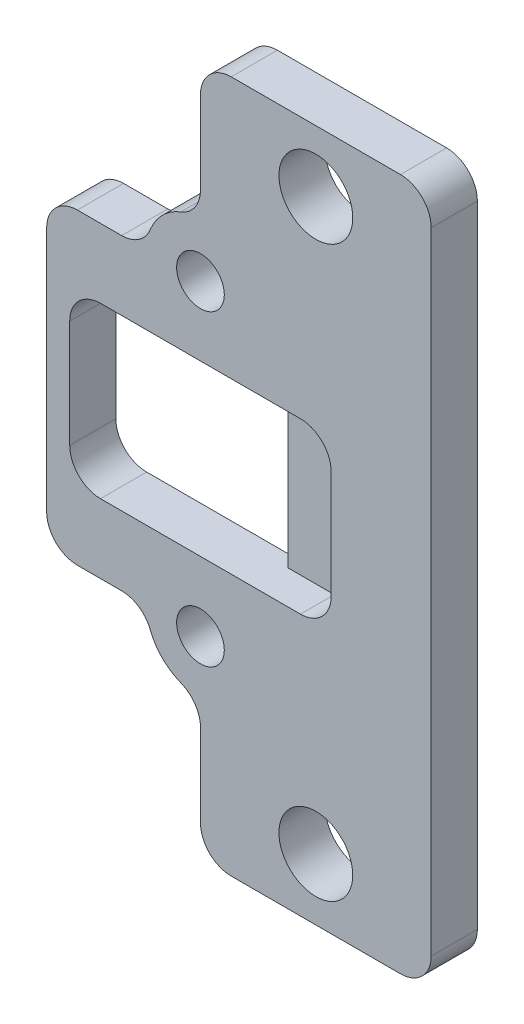
ISO-10303-21;
HEADER;
FILE_DESCRIPTION(('STEP AP214'),'2;1');
FILE_NAME('part.step','',(''),(''),'','','');
FILE_SCHEMA(('AUTOMOTIVE_DESIGN { 1 0 10303 214 1 1 1 1 }'));
ENDSEC;
DATA;
#1=APPLICATION_CONTEXT('core data for automotive mechanical design processes');
#2=APPLICATION_PROTOCOL_DEFINITION('international standard','automotive_design',2000,#1);
#3=PRODUCT_CONTEXT('',#1,'mechanical');
#4=PRODUCT('Part','Part','',(#3));
#5=PRODUCT_RELATED_PRODUCT_CATEGORY('part','',(#4));
#6=PRODUCT_DEFINITION_FORMATION('','',#4);
#7=PRODUCT_DEFINITION_CONTEXT('part definition',#1,'design');
#8=PRODUCT_DEFINITION('design','',#6,#7);
#9=PRODUCT_DEFINITION_SHAPE('','',#8);
#10=(LENGTH_UNIT() NAMED_UNIT(*) SI_UNIT(.MILLI.,.METRE.));
#11=(NAMED_UNIT(*) PLANE_ANGLE_UNIT() SI_UNIT($,.RADIAN.));
#12=(NAMED_UNIT(*) SI_UNIT($,.STERADIAN.) SOLID_ANGLE_UNIT());
#13=UNCERTAINTY_MEASURE_WITH_UNIT(LENGTH_MEASURE(1.E-05),#10,'distance_accuracy_value','');
#14=(GEOMETRIC_REPRESENTATION_CONTEXT(3) GLOBAL_UNCERTAINTY_ASSIGNED_CONTEXT((#13)) GLOBAL_UNIT_ASSIGNED_CONTEXT((#10,
#11,#12)) REPRESENTATION_CONTEXT('',''));
#15=CARTESIAN_POINT('',(0.,0.,0.));
#16=DIRECTION('',(0.,0.,1.));
#17=DIRECTION('',(1.,0.,0.));
#18=AXIS2_PLACEMENT_3D('',#15,#16,#17);
#19=CARTESIAN_POINT('',(-7.5,10.,3.));
#20=DIRECTION('',(0.,0.,-1.));
#21=DIRECTION('',(-1.,0.,0.));
#22=AXIS2_PLACEMENT_3D('',#19,#20,#21);
#23=CYLINDRICAL_SURFACE('',#22,1.55);
#24=CARTESIAN_POINT('',(-7.5,10.,3.));
#25=DIRECTION('',(0.,0.,1.));
#26=DIRECTION('',(1.,0.,0.));
#27=AXIS2_PLACEMENT_3D('',#24,#25,#26);
#28=CIRCLE('',#27,1.55);
#29=CARTESIAN_POINT('',(-5.95,10.,3.));
#30=VERTEX_POINT('',#29);
#31=EDGE_CURVE('E322',#30,#30,#28,.T.);
#32=ORIENTED_EDGE('',*,*,#31,.T.);
#33=EDGE_LOOP('',(#32));
#34=FACE_BOUND('',#33,.T.);
#35=CARTESIAN_POINT('',(-7.5,10.,0.));
#36=DIRECTION('',(0.,0.,1.));
#37=DIRECTION('',(1.,0.,0.));
#38=AXIS2_PLACEMENT_3D('',#35,#36,#37);
#39=CIRCLE('',#38,1.55);
#40=CARTESIAN_POINT('',(-5.95,10.,0.));
#41=VERTEX_POINT('',#40);
#42=EDGE_CURVE('E357',#41,#41,#39,.T.);
#43=ORIENTED_EDGE('',*,*,#42,.F.);
#44=EDGE_LOOP('',(#43));
#45=FACE_BOUND('',#44,.T.);
#46=ADVANCED_FACE('F113',(#34,#45),#23,.F.);
#47=CARTESIAN_POINT('',(0.,0.,0.));
#48=DIRECTION('',(0.,0.,1.));
#49=DIRECTION('',(1.,0.,0.));
#50=AXIS2_PLACEMENT_3D('',#47,#48,#49);
#51=PLANE('',#50);
#52=DIRECTION('',(0.,1.,0.));
#53=VECTOR('',#52,1.);
#54=CARTESIAN_POINT('',(-4.,-5.5,0.));
#55=LINE('',#54,#53);
#56=CARTESIAN_POINT('',(-4.,-5.5,0.));
#57=VERTEX_POINT('',#56);
#58=CARTESIAN_POINT('',(-4.,5.5,0.));
#59=VERTEX_POINT('',#58);
#60=EDGE_CURVE('E317',#57,#59,#55,.T.);
#61=ORIENTED_EDGE('',*,*,#60,.T.);
#62=DIRECTION('',(-1.,0.,0.));
#63=VECTOR('',#62,1.);
#64=CARTESIAN_POINT('',(0.,5.5,0.));
#65=LINE('',#64,#63);
#66=CARTESIAN_POINT('',(-14.,5.5,0.));
#67=VERTEX_POINT('',#66);
#68=EDGE_CURVE('E323',#59,#67,#65,.T.);
#69=ORIENTED_EDGE('',*,*,#68,.T.);
#70=CARTESIAN_POINT('',(-14.,3.5,0.));
#71=DIRECTION('',(0.,0.,1.));
#72=DIRECTION('',(1.,0.,0.));
#73=AXIS2_PLACEMENT_3D('',#70,#71,#72);
#74=CIRCLE('',#73,2.);
#75=CARTESIAN_POINT('',(-16.,3.5,0.));
#76=VERTEX_POINT('',#75);
#77=EDGE_CURVE('E553',#67,#76,#74,.T.);
#78=ORIENTED_EDGE('',*,*,#77,.T.);
#79=DIRECTION('',(0.,1.,0.));
#80=VECTOR('',#79,1.);
#81=CARTESIAN_POINT('',(-16.,0.,0.));
#82=LINE('',#81,#80);
#83=CARTESIAN_POINT('',(-16.,-3.5,0.));
#84=VERTEX_POINT('',#83);
#85=EDGE_CURVE('E437',#84,#76,#82,.T.);
#86=ORIENTED_EDGE('',*,*,#85,.F.);
#87=CARTESIAN_POINT('',(-14.,-3.5,0.));
#88=DIRECTION('',(0.,0.,1.));
#89=DIRECTION('',(1.,0.,0.));
#90=AXIS2_PLACEMENT_3D('',#87,#88,#89);
#91=CIRCLE('',#90,2.);
#92=CARTESIAN_POINT('',(-14.,-5.5,0.));
#93=VERTEX_POINT('',#92);
#94=EDGE_CURVE('E319',#84,#93,#91,.T.);
#95=ORIENTED_EDGE('',*,*,#94,.T.);
#96=DIRECTION('',(-1.,0.,0.));
#97=VECTOR('',#96,1.);
#98=CARTESIAN_POINT('',(0.,-5.5,0.));
#99=LINE('',#98,#97);
#100=EDGE_CURVE('E311',#57,#93,#99,.T.);
#101=ORIENTED_EDGE('',*,*,#100,.F.);
#102=EDGE_LOOP('',(#61,#69,#78,#86,#95,#101));
#103=FACE_BOUND('',#102,.T.);
#104=CARTESIAN_POINT('',(0.,-18.5,0.));
#105=DIRECTION('',(0.,0.,1.));
#106=DIRECTION('',(1.,0.,0.));
#107=AXIS2_PLACEMENT_3D('',#104,#105,#106);
#108=CIRCLE('',#107,2.4);
#109=CARTESIAN_POINT('',(2.4,-18.5,0.));
#110=VERTEX_POINT('',#109);
#111=EDGE_CURVE('E348',#110,#110,#108,.T.);
#112=ORIENTED_EDGE('',*,*,#111,.T.);
#113=EDGE_LOOP('',(#112));
#114=FACE_BOUND('',#113,.T.);
#115=CARTESIAN_POINT('',(0.,18.5,0.));
#116=DIRECTION('',(0.,0.,1.));
#117=DIRECTION('',(1.,0.,0.));
#118=AXIS2_PLACEMENT_3D('',#115,#116,#117);
#119=CIRCLE('',#118,2.4);
#120=CARTESIAN_POINT('',(2.4,18.5,0.));
#121=VERTEX_POINT('',#120);
#122=EDGE_CURVE('E354',#121,#121,#119,.T.);
#123=ORIENTED_EDGE('',*,*,#122,.T.);
#124=EDGE_LOOP('',(#123));
#125=FACE_BOUND('',#124,.T.);
#126=ORIENTED_EDGE('',*,*,#42,.T.);
#127=EDGE_LOOP('',(#126));
#128=FACE_BOUND('',#127,.T.);
#129=DIRECTION('',(0.,1.,0.));
#130=VECTOR('',#129,1.);
#131=CARTESIAN_POINT('',(-7.5,0.,0.));
#132=LINE('',#131,#130);
#133=CARTESIAN_POINT('',(-7.5,15.1234753829798,0.));
#134=VERTEX_POINT('',#133);
#135=CARTESIAN_POINT('',(-7.5,20.5,0.));
#136=VERTEX_POINT('',#135);
#137=EDGE_CURVE('E428',#134,#136,#132,.T.);
#138=ORIENTED_EDGE('',*,*,#137,.T.);
#139=CARTESIAN_POINT('',(-5.5,20.5,0.));
#140=DIRECTION('',(0.,0.,1.));
#141=DIRECTION('',(1.,0.,0.));
#142=AXIS2_PLACEMENT_3D('',#139,#140,#141);
#143=CIRCLE('',#142,2.);
#144=CARTESIAN_POINT('',(-5.5,22.5,0.));
#145=VERTEX_POINT('',#144);
#146=EDGE_CURVE('E455',#136,#145,#143,.F.);
#147=ORIENTED_EDGE('',*,*,#146,.T.);
#148=DIRECTION('',(-1.,0.,0.));
#149=VECTOR('',#148,1.);
#150=CARTESIAN_POINT('',(0.,22.5,0.));
#151=LINE('',#150,#149);
#152=CARTESIAN_POINT('',(5.5,22.5,0.));
#153=VERTEX_POINT('',#152);
#154=EDGE_CURVE('E434',#153,#145,#151,.T.);
#155=ORIENTED_EDGE('',*,*,#154,.F.);
#156=CARTESIAN_POINT('',(5.5,20.5,0.));
#157=DIRECTION('',(0.,0.,1.));
#158=DIRECTION('',(1.,0.,0.));
#159=AXIS2_PLACEMENT_3D('',#156,#157,#158);
#160=CIRCLE('',#159,2.);
#161=CARTESIAN_POINT('',(7.5,20.5,0.));
#162=VERTEX_POINT('',#161);
#163=EDGE_CURVE('E449',#153,#162,#160,.F.);
#164=ORIENTED_EDGE('',*,*,#163,.T.);
#165=DIRECTION('',(0.,1.,0.));
#166=VECTOR('',#165,1.);
#167=CARTESIAN_POINT('',(7.5,0.,0.));
#168=LINE('',#167,#166);
#169=CARTESIAN_POINT('',(7.5,-20.5,0.));
#170=VERTEX_POINT('',#169);
#171=EDGE_CURVE('E431',#170,#162,#168,.T.);
#172=ORIENTED_EDGE('',*,*,#171,.F.);
#173=CARTESIAN_POINT('',(5.5,-20.5,0.));
#174=DIRECTION('',(0.,0.,1.));
#175=DIRECTION('',(1.,0.,0.));
#176=AXIS2_PLACEMENT_3D('',#173,#174,#175);
#177=CIRCLE('',#176,2.);
#178=CARTESIAN_POINT('',(5.5,-22.5,0.));
#179=VERTEX_POINT('',#178);
#180=EDGE_CURVE('E447',#170,#179,#177,.F.);
#181=ORIENTED_EDGE('',*,*,#180,.T.);
#182=DIRECTION('',(-1.,0.,0.));
#183=VECTOR('',#182,1.);
#184=CARTESIAN_POINT('',(0.,-22.5,0.));
#185=LINE('',#184,#183);
#186=CARTESIAN_POINT('',(-5.5,-22.5,0.));
#187=VERTEX_POINT('',#186);
#188=EDGE_CURVE('E427',#179,#187,#185,.T.);
#189=ORIENTED_EDGE('',*,*,#188,.T.);
#190=CARTESIAN_POINT('',(-5.5,-20.5,0.));
#191=DIRECTION('',(0.,0.,1.));
#192=DIRECTION('',(1.,0.,0.));
#193=AXIS2_PLACEMENT_3D('',#190,#191,#192);
#194=CIRCLE('',#193,2.);
#195=CARTESIAN_POINT('',(-7.5,-20.5,0.));
#196=VERTEX_POINT('',#195);
#197=EDGE_CURVE('E445',#187,#196,#194,.F.);
#198=ORIENTED_EDGE('',*,*,#197,.T.);
#199=CARTESIAN_POINT('',(-7.5,-15.1234753829798,0.));
#200=VERTEX_POINT('',#199);
#201=EDGE_CURVE('E424',#196,#200,#132,.T.);
#202=ORIENTED_EDGE('',*,*,#201,.T.);
#203=CARTESIAN_POINT('',(-9.5,-15.1234753829798,0.));
#204=DIRECTION('',(0.,0.,1.));
#205=DIRECTION('',(1.,0.,0.));
#206=AXIS2_PLACEMENT_3D('',#203,#204,#205);
#207=CIRCLE('',#206,2.);
#208=CARTESIAN_POINT('',(-8.77272727272727,-13.2603934255326,0.));
#209=VERTEX_POINT('',#208);
#210=EDGE_CURVE('E542',#200,#209,#207,.T.);
#211=ORIENTED_EDGE('',*,*,#210,.T.);
#212=CARTESIAN_POINT('',(-7.5,-10.,0.));
#213=DIRECTION('',(0.,0.,1.));
#214=DIRECTION('',(1.,0.,0.));
#215=AXIS2_PLACEMENT_3D('',#212,#213,#214);
#216=CIRCLE('',#215,3.5);
#217=CARTESIAN_POINT('',(-10.7603934255326,-11.2727272727273,0.));
#218=VERTEX_POINT('',#217);
#219=EDGE_CURVE('E421',#218,#209,#216,.T.);
#220=ORIENTED_EDGE('',*,*,#219,.F.);
#221=CARTESIAN_POINT('',(-12.6234753829798,-12.,0.));
#222=DIRECTION('',(0.,0.,1.));
#223=DIRECTION('',(1.,0.,0.));
#224=AXIS2_PLACEMENT_3D('',#221,#222,#223);
#225=CIRCLE('',#224,2.);
#226=CARTESIAN_POINT('',(-12.6234753829798,-10.,0.));
#227=VERTEX_POINT('',#226);
#228=EDGE_CURVE('E546',#218,#227,#225,.T.);
#229=ORIENTED_EDGE('',*,*,#228,.T.);
#230=DIRECTION('',(1.,0.,0.));
#231=VECTOR('',#230,1.);
#232=CARTESIAN_POINT('',(0.,-10.,0.));
#233=LINE('',#232,#231);
#234=CARTESIAN_POINT('',(-15.5,-10.,0.));
#235=VERTEX_POINT('',#234);
#236=EDGE_CURVE('E418',#235,#227,#233,.T.);
#237=ORIENTED_EDGE('',*,*,#236,.F.);
#238=CARTESIAN_POINT('',(-15.5,-8.00000000000001,0.));
#239=DIRECTION('',(0.,0.,1.));
#240=DIRECTION('',(1.,0.,0.));
#241=AXIS2_PLACEMENT_3D('',#238,#239,#240);
#242=CIRCLE('',#241,2.);
#243=CARTESIAN_POINT('',(-17.5,-8.00000000000001,0.));
#244=VERTEX_POINT('',#243);
#245=EDGE_CURVE('E453',#235,#244,#242,.F.);
#246=ORIENTED_EDGE('',*,*,#245,.T.);
#247=DIRECTION('',(0.,1.,0.));
#248=VECTOR('',#247,1.);
#249=CARTESIAN_POINT('',(-17.5,0.,0.));
#250=LINE('',#249,#248);
#251=CARTESIAN_POINT('',(-17.5,7.99999999999999,0.));
#252=VERTEX_POINT('',#251);
#253=EDGE_CURVE('E415',#244,#252,#250,.T.);
#254=ORIENTED_EDGE('',*,*,#253,.T.);
#255=CARTESIAN_POINT('',(-15.5,7.99999999999999,0.));
#256=DIRECTION('',(0.,0.,1.));
#257=DIRECTION('',(1.,0.,0.));
#258=AXIS2_PLACEMENT_3D('',#255,#256,#257);
#259=CIRCLE('',#258,2.);
#260=CARTESIAN_POINT('',(-15.5,9.99999999999999,0.));
#261=VERTEX_POINT('',#260);
#262=EDGE_CURVE('E451',#252,#261,#259,.F.);
#263=ORIENTED_EDGE('',*,*,#262,.T.);
#264=DIRECTION('',(1.,0.,0.));
#265=VECTOR('',#264,1.);
#266=CARTESIAN_POINT('',(0.,10.,0.));
#267=LINE('',#266,#265);
#268=CARTESIAN_POINT('',(-12.6234753829798,9.99999999999999,0.));
#269=VERTEX_POINT('',#268);
#270=EDGE_CURVE('E412',#261,#269,#267,.T.);
#271=ORIENTED_EDGE('',*,*,#270,.T.);
#272=CARTESIAN_POINT('',(-12.6234753829798,12.,0.));
#273=DIRECTION('',(0.,0.,1.));
#274=DIRECTION('',(1.,0.,0.));
#275=AXIS2_PLACEMENT_3D('',#272,#273,#274);
#276=CIRCLE('',#275,2.);
#277=CARTESIAN_POINT('',(-10.7603934255326,11.2727272727273,0.));
#278=VERTEX_POINT('',#277);
#279=EDGE_CURVE('E538',#269,#278,#276,.T.);
#280=ORIENTED_EDGE('',*,*,#279,.T.);
#281=CARTESIAN_POINT('',(-7.5,10.,0.));
#282=DIRECTION('',(0.,0.,1.));
#283=DIRECTION('',(1.,0.,0.));
#284=AXIS2_PLACEMENT_3D('',#281,#282,#283);
#285=CIRCLE('',#284,3.5);
#286=CARTESIAN_POINT('',(-8.77272727272727,13.2603934255326,0.));
#287=VERTEX_POINT('',#286);
#288=EDGE_CURVE('E409',#287,#278,#285,.T.);
#289=ORIENTED_EDGE('',*,*,#288,.F.);
#290=CARTESIAN_POINT('',(-9.5,15.1234753829798,0.));
#291=DIRECTION('',(0.,0.,1.));
#292=DIRECTION('',(1.,0.,0.));
#293=AXIS2_PLACEMENT_3D('',#290,#291,#292);
#294=CIRCLE('',#293,2.);
#295=EDGE_CURVE('E534',#287,#134,#294,.T.);
#296=ORIENTED_EDGE('',*,*,#295,.T.);
#297=EDGE_LOOP('',(#138,#147,#155,#164,#172,#181,#189,#198,#202,#211,#220,#229,#237,#246,#254,
#263,#271,#280,#289,#296));
#298=FACE_BOUND('',#297,.T.);
#299=CARTESIAN_POINT('',(-7.5,-10.,0.));
#300=DIRECTION('',(0.,0.,1.));
#301=DIRECTION('',(1.,0.,0.));
#302=AXIS2_PLACEMENT_3D('',#299,#300,#301);
#303=CIRCLE('',#302,1.55);
#304=CARTESIAN_POINT('',(-5.95,-10.,0.));
#305=VERTEX_POINT('',#304);
#306=EDGE_CURVE('E406',#305,#305,#303,.T.);
#307=ORIENTED_EDGE('',*,*,#306,.T.);
#308=EDGE_LOOP('',(#307));
#309=FACE_BOUND('',#308,.T.);
#310=ADVANCED_FACE('F313',(#103,#114,#125,#128,#298,#309),#51,.F.);
#311=CARTESIAN_POINT('',(-7.5,10.,3.));
#312=DIRECTION('',(0.,0.,-1.));
#313=DIRECTION('',(-1.,0.,0.));
#314=AXIS2_PLACEMENT_3D('',#311,#312,#313);
#315=CYLINDRICAL_SURFACE('',#314,3.5);
#316=CARTESIAN_POINT('',(-7.5,10.,3.));
#317=DIRECTION('',(0.,0.,1.));
#318=DIRECTION('',(1.,0.,0.));
#319=AXIS2_PLACEMENT_3D('',#316,#317,#318);
#320=CIRCLE('',#319,3.5);
#321=CARTESIAN_POINT('',(-8.77272727272727,13.2603934255326,3.));
#322=VERTEX_POINT('',#321);
#323=CARTESIAN_POINT('',(-10.7603934255326,11.2727272727273,3.));
#324=VERTEX_POINT('',#323);
#325=EDGE_CURVE('E363',#322,#324,#320,.T.);
#326=ORIENTED_EDGE('',*,*,#325,.F.);
#327=DIRECTION('',(0.,0.,-1.));
#328=VECTOR('',#327,1.);
#329=CARTESIAN_POINT('',(-8.77272727272727,13.2603934255326,3.));
#330=LINE('',#329,#328);
#331=EDGE_CURVE('E476',#322,#287,#330,.T.);
#332=ORIENTED_EDGE('',*,*,#331,.T.);
#333=ORIENTED_EDGE('',*,*,#288,.T.);
#334=DIRECTION('',(0.,0.,-1.));
#335=VECTOR('',#334,1.);
#336=CARTESIAN_POINT('',(-10.7603934255326,11.2727272727273,3.));
#337=LINE('',#336,#335);
#338=EDGE_CURVE('E474',#278,#324,#337,.F.);
#339=ORIENTED_EDGE('',*,*,#338,.T.);
#340=EDGE_LOOP('',(#326,#332,#333,#339));
#341=FACE_BOUND('',#340,.T.);
#342=ADVANCED_FACE('F582',(#341),#315,.T.);
#343=CARTESIAN_POINT('',(0.,0.,3.));
#344=DIRECTION('',(0.,0.,1.));
#345=DIRECTION('',(1.,0.,0.));
#346=AXIS2_PLACEMENT_3D('',#343,#344,#345);
#347=PLANE('',#346);
#348=CARTESIAN_POINT('',(0.,-18.5,3.));
#349=DIRECTION('',(0.,0.,1.));
#350=DIRECTION('',(1.,0.,0.));
#351=AXIS2_PLACEMENT_3D('',#348,#349,#350);
#352=CIRCLE('',#351,2.4);
#353=CARTESIAN_POINT('',(2.4,-18.5,3.));
#354=VERTEX_POINT('',#353);
#355=EDGE_CURVE('E344',#354,#354,#352,.T.);
#356=ORIENTED_EDGE('',*,*,#355,.F.);
#357=EDGE_LOOP('',(#356));
#358=FACE_BOUND('',#357,.T.);
#359=CARTESIAN_POINT('',(0.,18.5,3.));
#360=DIRECTION('',(0.,0.,1.));
#361=DIRECTION('',(1.,0.,0.));
#362=AXIS2_PLACEMENT_3D('',#359,#360,#361);
#363=CIRCLE('',#362,2.4);
#364=CARTESIAN_POINT('',(2.4,18.5,3.));
#365=VERTEX_POINT('',#364);
#366=EDGE_CURVE('E351',#365,#365,#363,.T.);
#367=ORIENTED_EDGE('',*,*,#366,.F.);
#368=EDGE_LOOP('',(#367));
#369=FACE_BOUND('',#368,.T.);
#370=DIRECTION('',(-1.,0.,0.));
#371=VECTOR('',#370,1.);
#372=CARTESIAN_POINT('',(0.,22.5,3.));
#373=LINE('',#372,#371);
#374=CARTESIAN_POINT('',(5.5,22.5,3.));
#375=VERTEX_POINT('',#374);
#376=CARTESIAN_POINT('',(-5.5,22.5,3.));
#377=VERTEX_POINT('',#376);
#378=EDGE_CURVE('E388',#375,#377,#373,.T.);
#379=ORIENTED_EDGE('',*,*,#378,.T.);
#380=CARTESIAN_POINT('',(-5.5,20.5,3.));
#381=DIRECTION('',(0.,0.,1.));
#382=DIRECTION('',(1.,0.,0.));
#383=AXIS2_PLACEMENT_3D('',#380,#381,#382);
#384=CIRCLE('',#383,2.);
#385=CARTESIAN_POINT('',(-7.5,20.5,3.));
#386=VERTEX_POINT('',#385);
#387=EDGE_CURVE('E472',#377,#386,#384,.T.);
#388=ORIENTED_EDGE('',*,*,#387,.T.);
#389=DIRECTION('',(0.,1.,0.));
#390=VECTOR('',#389,1.);
#391=CARTESIAN_POINT('',(-7.5,0.,3.));
#392=LINE('',#391,#390);
#393=CARTESIAN_POINT('',(-7.5,15.1234753829798,3.));
#394=VERTEX_POINT('',#393);
#395=EDGE_CURVE('E382',#394,#386,#392,.T.);
#396=ORIENTED_EDGE('',*,*,#395,.F.);
#397=CARTESIAN_POINT('',(-9.5,15.1234753829798,3.));
#398=DIRECTION('',(0.,0.,1.));
#399=DIRECTION('',(1.,0.,0.));
#400=AXIS2_PLACEMENT_3D('',#397,#398,#399);
#401=CIRCLE('',#400,2.);
#402=EDGE_CURVE('E536',#394,#322,#401,.F.);
#403=ORIENTED_EDGE('',*,*,#402,.T.);
#404=ORIENTED_EDGE('',*,*,#325,.T.);
#405=CARTESIAN_POINT('',(-12.6234753829798,12.,3.));
#406=DIRECTION('',(0.,0.,1.));
#407=DIRECTION('',(1.,0.,0.));
#408=AXIS2_PLACEMENT_3D('',#405,#406,#407);
#409=CIRCLE('',#408,2.);
#410=CARTESIAN_POINT('',(-12.6234753829798,9.99999999999999,3.));
#411=VERTEX_POINT('',#410);
#412=EDGE_CURVE('E540',#324,#411,#409,.F.);
#413=ORIENTED_EDGE('',*,*,#412,.T.);
#414=DIRECTION('',(1.,0.,0.));
#415=VECTOR('',#414,1.);
#416=CARTESIAN_POINT('',(0.,10.,3.));
#417=LINE('',#416,#415);
#418=CARTESIAN_POINT('',(-15.5,9.99999999999999,3.));
#419=VERTEX_POINT('',#418);
#420=EDGE_CURVE('E366',#419,#411,#417,.T.);
#421=ORIENTED_EDGE('',*,*,#420,.F.);
#422=CARTESIAN_POINT('',(-15.5,7.99999999999999,3.));
#423=DIRECTION('',(0.,0.,1.));
#424=DIRECTION('',(1.,0.,0.));
#425=AXIS2_PLACEMENT_3D('',#422,#423,#424);
#426=CIRCLE('',#425,2.);
#427=CARTESIAN_POINT('',(-17.5,7.99999999999999,3.));
#428=VERTEX_POINT('',#427);
#429=EDGE_CURVE('E468',#419,#428,#426,.T.);
#430=ORIENTED_EDGE('',*,*,#429,.T.);
#431=DIRECTION('',(0.,1.,0.));
#432=VECTOR('',#431,1.);
#433=CARTESIAN_POINT('',(-17.5,0.,3.));
#434=LINE('',#433,#432);
#435=CARTESIAN_POINT('',(-17.5,-8.00000000000001,3.));
#436=VERTEX_POINT('',#435);
#437=EDGE_CURVE('E369',#436,#428,#434,.T.);
#438=ORIENTED_EDGE('',*,*,#437,.F.);
#439=CARTESIAN_POINT('',(-15.5,-8.00000000000001,3.));
#440=DIRECTION('',(0.,0.,1.));
#441=DIRECTION('',(1.,0.,0.));
#442=AXIS2_PLACEMENT_3D('',#439,#440,#441);
#443=CIRCLE('',#442,2.);
#444=CARTESIAN_POINT('',(-15.5,-10.,3.));
#445=VERTEX_POINT('',#444);
#446=EDGE_CURVE('E470',#436,#445,#443,.T.);
#447=ORIENTED_EDGE('',*,*,#446,.T.);
#448=DIRECTION('',(1.,0.,0.));
#449=VECTOR('',#448,1.);
#450=CARTESIAN_POINT('',(0.,-10.,3.));
#451=LINE('',#450,#449);
#452=CARTESIAN_POINT('',(-12.6234753829798,-10.,3.));
#453=VERTEX_POINT('',#452);
#454=EDGE_CURVE('E372',#445,#453,#451,.T.);
#455=ORIENTED_EDGE('',*,*,#454,.T.);
#456=CARTESIAN_POINT('',(-12.6234753829798,-12.,3.));
#457=DIRECTION('',(0.,0.,1.));
#458=DIRECTION('',(1.,0.,0.));
#459=AXIS2_PLACEMENT_3D('',#456,#457,#458);
#460=CIRCLE('',#459,2.);
#461=CARTESIAN_POINT('',(-10.7603934255326,-11.2727272727273,3.));
#462=VERTEX_POINT('',#461);
#463=EDGE_CURVE('E548',#453,#462,#460,.F.);
#464=ORIENTED_EDGE('',*,*,#463,.T.);
#465=CARTESIAN_POINT('',(-7.5,-10.,3.));
#466=DIRECTION('',(0.,0.,1.));
#467=DIRECTION('',(1.,0.,0.));
#468=AXIS2_PLACEMENT_3D('',#465,#466,#467);
#469=CIRCLE('',#468,3.5);
#470=CARTESIAN_POINT('',(-8.77272727272727,-13.2603934255326,3.));
#471=VERTEX_POINT('',#470);
#472=EDGE_CURVE('E375',#462,#471,#469,.T.);
#473=ORIENTED_EDGE('',*,*,#472,.T.);
#474=CARTESIAN_POINT('',(-9.5,-15.1234753829798,3.));
#475=DIRECTION('',(0.,0.,1.));
#476=DIRECTION('',(1.,0.,0.));
#477=AXIS2_PLACEMENT_3D('',#474,#475,#476);
#478=CIRCLE('',#477,2.);
#479=CARTESIAN_POINT('',(-7.5,-15.1234753829798,3.));
#480=VERTEX_POINT('',#479);
#481=EDGE_CURVE('E544',#471,#480,#478,.F.);
#482=ORIENTED_EDGE('',*,*,#481,.T.);
#483=CARTESIAN_POINT('',(-7.5,-20.5,3.));
#484=VERTEX_POINT('',#483);
#485=EDGE_CURVE('E378',#484,#480,#392,.T.);
#486=ORIENTED_EDGE('',*,*,#485,.F.);
#487=CARTESIAN_POINT('',(-5.5,-20.5,3.));
#488=DIRECTION('',(0.,0.,1.));
#489=DIRECTION('',(1.,0.,0.));
#490=AXIS2_PLACEMENT_3D('',#487,#488,#489);
#491=CIRCLE('',#490,2.);
#492=CARTESIAN_POINT('',(-5.5,-22.5,3.));
#493=VERTEX_POINT('',#492);
#494=EDGE_CURVE('E462',#484,#493,#491,.T.);
#495=ORIENTED_EDGE('',*,*,#494,.T.);
#496=DIRECTION('',(-1.,0.,0.));
#497=VECTOR('',#496,1.);
#498=CARTESIAN_POINT('',(0.,-22.5,3.));
#499=LINE('',#498,#497);
#500=CARTESIAN_POINT('',(5.5,-22.5,3.));
#501=VERTEX_POINT('',#500);
#502=EDGE_CURVE('E381',#501,#493,#499,.T.);
#503=ORIENTED_EDGE('',*,*,#502,.F.);
#504=CARTESIAN_POINT('',(5.5,-20.5,3.));
#505=DIRECTION('',(0.,0.,1.));
#506=DIRECTION('',(1.,0.,0.));
#507=AXIS2_PLACEMENT_3D('',#504,#505,#506);
#508=CIRCLE('',#507,2.);
#509=CARTESIAN_POINT('',(7.5,-20.5,3.));
#510=VERTEX_POINT('',#509);
#511=EDGE_CURVE('E464',#501,#510,#508,.T.);
#512=ORIENTED_EDGE('',*,*,#511,.T.);
#513=DIRECTION('',(0.,1.,0.));
#514=VECTOR('',#513,1.);
#515=CARTESIAN_POINT('',(7.5,0.,3.));
#516=LINE('',#515,#514);
#517=CARTESIAN_POINT('',(7.5,20.5,3.));
#518=VERTEX_POINT('',#517);
#519=EDGE_CURVE('E385',#510,#518,#516,.T.);
#520=ORIENTED_EDGE('',*,*,#519,.T.);
#521=CARTESIAN_POINT('',(5.5,20.5,3.));
#522=DIRECTION('',(0.,0.,1.));
#523=DIRECTION('',(1.,0.,0.));
#524=AXIS2_PLACEMENT_3D('',#521,#522,#523);
#525=CIRCLE('',#524,2.);
#526=EDGE_CURVE('E466',#518,#375,#525,.T.);
#527=ORIENTED_EDGE('',*,*,#526,.T.);
#528=EDGE_LOOP('',(#379,#388,#396,#403,#404,#413,#421,#430,#438,#447,#455,#464,#473,#482,#486,
#495,#503,#512,#520,#527));
#529=FACE_BOUND('',#528,.T.);
#530=ORIENTED_EDGE('',*,*,#31,.F.);
#531=EDGE_LOOP('',(#530));
#532=FACE_BOUND('',#531,.T.);
#533=DIRECTION('',(-1.,0.,0.));
#534=VECTOR('',#533,1.);
#535=CARTESIAN_POINT('',(0.,-5.5,3.));
#536=LINE('',#535,#534);
#537=CARTESIAN_POINT('',(-0.999999999999999,-5.5,3.));
#538=VERTEX_POINT('',#537);
#539=CARTESIAN_POINT('',(-14.,-5.5,3.));
#540=VERTEX_POINT('',#539);
#541=EDGE_CURVE('E400',#538,#540,#536,.T.);
#542=ORIENTED_EDGE('',*,*,#541,.T.);
#543=CARTESIAN_POINT('',(-14.,-3.5,3.));
#544=DIRECTION('',(0.,0.,1.));
#545=DIRECTION('',(1.,0.,0.));
#546=AXIS2_PLACEMENT_3D('',#543,#544,#545);
#547=CIRCLE('',#546,2.);
#548=CARTESIAN_POINT('',(-16.,-3.5,3.));
#549=VERTEX_POINT('',#548);
#550=EDGE_CURVE('E551',#540,#549,#547,.F.);
#551=ORIENTED_EDGE('',*,*,#550,.T.);
#552=DIRECTION('',(0.,1.,0.));
#553=VECTOR('',#552,1.);
#554=CARTESIAN_POINT('',(-16.,0.,3.));
#555=LINE('',#554,#553);
#556=CARTESIAN_POINT('',(-16.,3.5,3.));
#557=VERTEX_POINT('',#556);
#558=EDGE_CURVE('E391',#549,#557,#555,.T.);
#559=ORIENTED_EDGE('',*,*,#558,.T.);
#560=CARTESIAN_POINT('',(-14.,3.5,3.));
#561=DIRECTION('',(0.,0.,1.));
#562=DIRECTION('',(1.,0.,0.));
#563=AXIS2_PLACEMENT_3D('',#560,#561,#562);
#564=CIRCLE('',#563,2.);
#565=CARTESIAN_POINT('',(-14.,5.5,3.));
#566=VERTEX_POINT('',#565);
#567=EDGE_CURVE('E555',#557,#566,#564,.F.);
#568=ORIENTED_EDGE('',*,*,#567,.T.);
#569=DIRECTION('',(-1.,0.,0.));
#570=VECTOR('',#569,1.);
#571=CARTESIAN_POINT('',(0.,5.5,3.));
#572=LINE('',#571,#570);
#573=CARTESIAN_POINT('',(-0.999999999999999,5.5,3.));
#574=VERTEX_POINT('',#573);
#575=EDGE_CURVE('E394',#574,#566,#572,.T.);
#576=ORIENTED_EDGE('',*,*,#575,.F.);
#577=CARTESIAN_POINT('',(-0.999999999999999,3.5,3.));
#578=DIRECTION('',(0.,0.,1.));
#579=DIRECTION('',(1.,0.,0.));
#580=AXIS2_PLACEMENT_3D('',#577,#578,#579);
#581=CIRCLE('',#580,2.);
#582=CARTESIAN_POINT('',(1.,3.5,3.));
#583=VERTEX_POINT('',#582);
#584=EDGE_CURVE('E121',#574,#583,#581,.F.);
#585=ORIENTED_EDGE('',*,*,#584,.T.);
#586=DIRECTION('',(0.,1.,0.));
#587=VECTOR('',#586,1.);
#588=CARTESIAN_POINT('',(1.,0.,3.));
#589=LINE('',#588,#587);
#590=CARTESIAN_POINT('',(1.,-3.5,3.));
#591=VERTEX_POINT('',#590);
#592=EDGE_CURVE('E397',#591,#583,#589,.T.);
#593=ORIENTED_EDGE('',*,*,#592,.F.);
#594=CARTESIAN_POINT('',(-0.999999999999999,-3.5,3.));
#595=DIRECTION('',(0.,0.,1.));
#596=DIRECTION('',(1.,0.,0.));
#597=AXIS2_PLACEMENT_3D('',#594,#595,#596);
#598=CIRCLE('',#597,2.);
#599=EDGE_CURVE('E12',#591,#538,#598,.F.);
#600=ORIENTED_EDGE('',*,*,#599,.T.);
#601=EDGE_LOOP('',(#542,#551,#559,#568,#576,#585,#593,#600));
#602=FACE_BOUND('',#601,.T.);
#603=CARTESIAN_POINT('',(-7.5,-10.,3.));
#604=DIRECTION('',(0.,0.,1.));
#605=DIRECTION('',(1.,0.,0.));
#606=AXIS2_PLACEMENT_3D('',#603,#604,#605);
#607=CIRCLE('',#606,1.55);
#608=CARTESIAN_POINT('',(-5.95,-10.,3.));
#609=VERTEX_POINT('',#608);
#610=EDGE_CURVE('E360',#609,#609,#607,.T.);
#611=ORIENTED_EDGE('',*,*,#610,.F.);
#612=EDGE_LOOP('',(#611));
#613=FACE_BOUND('',#612,.T.);
#614=ADVANCED_FACE('F560',(#358,#369,#529,#532,#602,#613),#347,.T.);
#615=CARTESIAN_POINT('',(0.,10.,3.));
#616=DIRECTION('',(0.,1.,0.));
#617=DIRECTION('',(-1.,0.,0.));
#618=AXIS2_PLACEMENT_3D('',#615,#616,#617);
#619=PLANE('',#618);
#620=ORIENTED_EDGE('',*,*,#420,.T.);
#621=DIRECTION('',(0.,0.,-1.));
#622=VECTOR('',#621,1.);
#623=CARTESIAN_POINT('',(-12.6234753829798,9.99999999999999,3.));
#624=LINE('',#623,#622);
#625=EDGE_CURVE('E481',#411,#269,#624,.T.);
#626=ORIENTED_EDGE('',*,*,#625,.T.);
#627=ORIENTED_EDGE('',*,*,#270,.F.);
#628=DIRECTION('',(0.,0.,-1.));
#629=VECTOR('',#628,1.);
#630=CARTESIAN_POINT('',(-15.5,9.99999999999999,3.));
#631=LINE('',#630,#629);
#632=EDGE_CURVE('E479',#261,#419,#631,.F.);
#633=ORIENTED_EDGE('',*,*,#632,.T.);
#634=EDGE_LOOP('',(#620,#626,#627,#633));
#635=FACE_BOUND('',#634,.T.);
#636=ADVANCED_FACE('F594',(#635),#619,.T.);
#637=CARTESIAN_POINT('',(-17.5,0.,3.));
#638=DIRECTION('',(-1.,0.,0.));
#639=DIRECTION('',(0.,0.,1.));
#640=AXIS2_PLACEMENT_3D('',#637,#638,#639);
#641=PLANE('',#640);
#642=ORIENTED_EDGE('',*,*,#253,.F.);
#643=DIRECTION('',(0.,0.,-1.));
#644=VECTOR('',#643,1.);
#645=CARTESIAN_POINT('',(-17.5,-8.00000000000001,3.));
#646=LINE('',#645,#644);
#647=EDGE_CURVE('E522',#244,#436,#646,.F.);
#648=ORIENTED_EDGE('',*,*,#647,.T.);
#649=ORIENTED_EDGE('',*,*,#437,.T.);
#650=DIRECTION('',(0.,0.,-1.));
#651=VECTOR('',#650,1.);
#652=CARTESIAN_POINT('',(-17.5,7.99999999999999,3.));
#653=LINE('',#652,#651);
#654=EDGE_CURVE('E519',#428,#252,#653,.T.);
#655=ORIENTED_EDGE('',*,*,#654,.T.);
#656=EDGE_LOOP('',(#642,#648,#649,#655));
#657=FACE_BOUND('',#656,.T.);
#658=ADVANCED_FACE('F635',(#657),#641,.T.);
#659=CARTESIAN_POINT('',(0.,-10.,3.));
#660=DIRECTION('',(0.,1.,0.));
#661=DIRECTION('',(-1.,0.,0.));
#662=AXIS2_PLACEMENT_3D('',#659,#660,#661);
#663=PLANE('',#662);
#664=ORIENTED_EDGE('',*,*,#236,.T.);
#665=DIRECTION('',(0.,0.,1.));
#666=VECTOR('',#665,1.);
#667=CARTESIAN_POINT('',(-12.6234753829798,-10.,3.));
#668=LINE('',#667,#666);
#669=EDGE_CURVE('E497',#227,#453,#668,.T.);
#670=ORIENTED_EDGE('',*,*,#669,.T.);
#671=ORIENTED_EDGE('',*,*,#454,.F.);
#672=DIRECTION('',(0.,0.,-1.));
#673=VECTOR('',#672,1.);
#674=CARTESIAN_POINT('',(-15.5,-10.,0.));
#675=LINE('',#674,#673);
#676=EDGE_CURVE('E494',#445,#235,#675,.T.);
#677=ORIENTED_EDGE('',*,*,#676,.T.);
#678=EDGE_LOOP('',(#664,#670,#671,#677));
#679=FACE_BOUND('',#678,.T.);
#680=ADVANCED_FACE('F631',(#679),#663,.F.);
#681=CARTESIAN_POINT('',(-7.5,-10.,3.));
#682=DIRECTION('',(0.,0.,-1.));
#683=DIRECTION('',(-1.,0.,0.));
#684=AXIS2_PLACEMENT_3D('',#681,#682,#683);
#685=CYLINDRICAL_SURFACE('',#684,3.5);
#686=ORIENTED_EDGE('',*,*,#219,.T.);
#687=DIRECTION('',(0.,0.,-1.));
#688=VECTOR('',#687,1.);
#689=CARTESIAN_POINT('',(-8.77272727272727,-13.2603934255326,3.));
#690=LINE('',#689,#688);
#691=EDGE_CURVE('E492',#209,#471,#690,.F.);
#692=ORIENTED_EDGE('',*,*,#691,.T.);
#693=ORIENTED_EDGE('',*,*,#472,.F.);
#694=DIRECTION('',(0.,0.,-1.));
#695=VECTOR('',#694,1.);
#696=CARTESIAN_POINT('',(-10.7603934255326,-11.2727272727273,3.));
#697=LINE('',#696,#695);
#698=EDGE_CURVE('E489',#462,#218,#697,.T.);
#699=ORIENTED_EDGE('',*,*,#698,.T.);
#700=EDGE_LOOP('',(#686,#692,#693,#699));
#701=FACE_BOUND('',#700,.T.);
#702=ADVANCED_FACE('F628',(#701),#685,.T.);
#703=CARTESIAN_POINT('',(-7.5,0.,3.));
#704=DIRECTION('',(-1.,0.,0.));
#705=DIRECTION('',(0.,0.,1.));
#706=AXIS2_PLACEMENT_3D('',#703,#704,#705);
#707=PLANE('',#706);
#708=ORIENTED_EDGE('',*,*,#485,.T.);
#709=DIRECTION('',(0.,0.,-1.));
#710=VECTOR('',#709,1.);
#711=CARTESIAN_POINT('',(-7.5,-15.1234753829798,3.));
#712=LINE('',#711,#710);
#713=EDGE_CURVE('E486',#480,#200,#712,.T.);
#714=ORIENTED_EDGE('',*,*,#713,.T.);
#715=ORIENTED_EDGE('',*,*,#201,.F.);
#716=DIRECTION('',(0.,0.,-1.));
#717=VECTOR('',#716,1.);
#718=CARTESIAN_POINT('',(-7.5,-20.5,3.));
#719=LINE('',#718,#717);
#720=EDGE_CURVE('E484',#196,#484,#719,.F.);
#721=ORIENTED_EDGE('',*,*,#720,.T.);
#722=EDGE_LOOP('',(#708,#714,#715,#721));
#723=FACE_BOUND('',#722,.T.);
#724=ADVANCED_FACE('F616',(#723),#707,.T.);
#725=CARTESIAN_POINT('',(0.,-22.5,3.));
#726=DIRECTION('',(0.,-1.,0.));
#727=DIRECTION('',(0.,0.,-1.));
#728=AXIS2_PLACEMENT_3D('',#725,#726,#727);
#729=PLANE('',#728);
#730=ORIENTED_EDGE('',*,*,#188,.F.);
#731=DIRECTION('',(0.,0.,-1.));
#732=VECTOR('',#731,1.);
#733=CARTESIAN_POINT('',(5.5,-22.5,3.));
#734=LINE('',#733,#732);
#735=EDGE_CURVE('E532',#179,#501,#734,.F.);
#736=ORIENTED_EDGE('',*,*,#735,.T.);
#737=ORIENTED_EDGE('',*,*,#502,.T.);
#738=DIRECTION('',(0.,0.,-1.));
#739=VECTOR('',#738,1.);
#740=CARTESIAN_POINT('',(-5.5,-22.5,3.));
#741=LINE('',#740,#739);
#742=EDGE_CURVE('E529',#493,#187,#741,.T.);
#743=ORIENTED_EDGE('',*,*,#742,.T.);
#744=EDGE_LOOP('',(#730,#736,#737,#743));
#745=FACE_BOUND('',#744,.T.);
#746=ADVANCED_FACE('F623',(#745),#729,.T.);
#747=CARTESIAN_POINT('',(7.5,0.,3.));
#748=DIRECTION('',(-1.,0.,0.));
#749=DIRECTION('',(0.,0.,1.));
#750=AXIS2_PLACEMENT_3D('',#747,#748,#749);
#751=PLANE('',#750);
#752=ORIENTED_EDGE('',*,*,#171,.T.);
#753=DIRECTION('',(0.,0.,-1.));
#754=VECTOR('',#753,1.);
#755=CARTESIAN_POINT('',(7.5,20.5,3.));
#756=LINE('',#755,#754);
#757=EDGE_CURVE('E527',#162,#518,#756,.F.);
#758=ORIENTED_EDGE('',*,*,#757,.T.);
#759=ORIENTED_EDGE('',*,*,#519,.F.);
#760=DIRECTION('',(0.,0.,-1.));
#761=VECTOR('',#760,1.);
#762=CARTESIAN_POINT('',(7.5,-20.5,0.));
#763=LINE('',#762,#761);
#764=EDGE_CURVE('E524',#510,#170,#763,.T.);
#765=ORIENTED_EDGE('',*,*,#764,.T.);
#766=EDGE_LOOP('',(#752,#758,#759,#765));
#767=FACE_BOUND('',#766,.T.);
#768=ADVANCED_FACE('F619',(#767),#751,.F.);
#769=CARTESIAN_POINT('',(0.,22.5,3.));
#770=DIRECTION('',(0.,-1.,0.));
#771=DIRECTION('',(0.,0.,-1.));
#772=AXIS2_PLACEMENT_3D('',#769,#770,#771);
#773=PLANE('',#772);
#774=ORIENTED_EDGE('',*,*,#154,.T.);
#775=DIRECTION('',(0.,0.,-1.));
#776=VECTOR('',#775,1.);
#777=CARTESIAN_POINT('',(-5.5,22.5,3.));
#778=LINE('',#777,#776);
#779=EDGE_CURVE('E460',#145,#377,#778,.F.);
#780=ORIENTED_EDGE('',*,*,#779,.T.);
#781=ORIENTED_EDGE('',*,*,#378,.F.);
#782=DIRECTION('',(0.,0.,-1.));
#783=VECTOR('',#782,1.);
#784=CARTESIAN_POINT('',(5.5,22.5,3.));
#785=LINE('',#784,#783);
#786=EDGE_CURVE('E457',#375,#153,#785,.T.);
#787=ORIENTED_EDGE('',*,*,#786,.T.);
#788=EDGE_LOOP('',(#774,#780,#781,#787));
#789=FACE_BOUND('',#788,.T.);
#790=ADVANCED_FACE('F614',(#789),#773,.F.);
#791=ORIENTED_EDGE('',*,*,#395,.T.);
#792=DIRECTION('',(0.,0.,-1.));
#793=VECTOR('',#792,1.);
#794=CARTESIAN_POINT('',(-7.5,20.5,0.));
#795=LINE('',#794,#793);
#796=EDGE_CURVE('E442',#386,#136,#795,.T.);
#797=ORIENTED_EDGE('',*,*,#796,.T.);
#798=ORIENTED_EDGE('',*,*,#137,.F.);
#799=DIRECTION('',(0.,0.,-1.));
#800=VECTOR('',#799,1.);
#801=CARTESIAN_POINT('',(-7.5,15.1234753829798,3.));
#802=LINE('',#801,#800);
#803=EDGE_CURVE('E403',#134,#394,#802,.F.);
#804=ORIENTED_EDGE('',*,*,#803,.T.);
#805=EDGE_LOOP('',(#791,#797,#798,#804));
#806=FACE_BOUND('',#805,.T.);
#807=ADVANCED_FACE('F611',(#806),#707,.T.);
#808=CARTESIAN_POINT('',(-7.5,-10.,3.));
#809=DIRECTION('',(0.,0.,-1.));
#810=DIRECTION('',(-1.,0.,0.));
#811=AXIS2_PLACEMENT_3D('',#808,#809,#810);
#812=CYLINDRICAL_SURFACE('',#811,1.55);
#813=ORIENTED_EDGE('',*,*,#610,.T.);
#814=EDGE_LOOP('',(#813));
#815=FACE_BOUND('',#814,.T.);
#816=ORIENTED_EDGE('',*,*,#306,.F.);
#817=EDGE_LOOP('',(#816));
#818=FACE_BOUND('',#817,.T.);
#819=ADVANCED_FACE('F605',(#815,#818),#812,.F.);
#820=CARTESIAN_POINT('',(0.,5.5,3.));
#821=DIRECTION('',(0.,-1.,0.));
#822=DIRECTION('',(0.,0.,-1.));
#823=AXIS2_PLACEMENT_3D('',#820,#821,#822);
#824=PLANE('',#823);
#825=ORIENTED_EDGE('',*,*,#575,.T.);
#826=DIRECTION('',(0.,0.,-1.));
#827=VECTOR('',#826,1.);
#828=CARTESIAN_POINT('',(-14.,5.5,3.));
#829=LINE('',#828,#827);
#830=EDGE_CURVE('E510',#566,#67,#829,.T.);
#831=ORIENTED_EDGE('',*,*,#830,.T.);
#832=ORIENTED_EDGE('',*,*,#68,.F.);
#833=DIRECTION('',(0.,0.,-1.));
#834=VECTOR('',#833,1.);
#835=CARTESIAN_POINT('',(-4.,5.5,0.8));
#836=LINE('',#835,#834);
#837=CARTESIAN_POINT('',(-4.,5.5,0.8));
#838=VERTEX_POINT('',#837);
#839=EDGE_CURVE('E333',#838,#59,#836,.T.);
#840=ORIENTED_EDGE('',*,*,#839,.F.);
#841=DIRECTION('',(1.,0.,0.));
#842=VECTOR('',#841,1.);
#843=CARTESIAN_POINT('',(1.,5.5,0.8));
#844=LINE('',#843,#842);
#845=CARTESIAN_POINT('',(-0.999999999999999,5.5,0.8));
#846=VERTEX_POINT('',#845);
#847=EDGE_CURVE('E334',#838,#846,#844,.T.);
#848=ORIENTED_EDGE('',*,*,#847,.T.);
#849=DIRECTION('',(0.,0.,-1.));
#850=VECTOR('',#849,1.);
#851=CARTESIAN_POINT('',(-0.999999999999999,5.5,3.));
#852=LINE('',#851,#850);
#853=EDGE_CURVE('E508',#846,#574,#852,.F.);
#854=ORIENTED_EDGE('',*,*,#853,.T.);
#855=EDGE_LOOP('',(#825,#831,#832,#840,#848,#854));
#856=FACE_BOUND('',#855,.T.);
#857=ADVANCED_FACE('F602',(#856),#824,.T.);
#858=CARTESIAN_POINT('',(1.,0.,3.));
#859=DIRECTION('',(-1.,0.,0.));
#860=DIRECTION('',(0.,0.,1.));
#861=AXIS2_PLACEMENT_3D('',#858,#859,#860);
#862=PLANE('',#861);
#863=ORIENTED_EDGE('',*,*,#592,.T.);
#864=DIRECTION('',(0.,0.,-1.));
#865=VECTOR('',#864,1.);
#866=CARTESIAN_POINT('',(1.,3.5,0.8));
#867=LINE('',#866,#865);
#868=CARTESIAN_POINT('',(1.,3.5,0.8));
#869=VERTEX_POINT('',#868);
#870=EDGE_CURVE('E515',#583,#869,#867,.T.);
#871=ORIENTED_EDGE('',*,*,#870,.T.);
#872=DIRECTION('',(0.,-1.,0.));
#873=VECTOR('',#872,1.);
#874=CARTESIAN_POINT('',(1.,-5.5,0.8));
#875=LINE('',#874,#873);
#876=CARTESIAN_POINT('',(1.,-3.5,0.8));
#877=VERTEX_POINT('',#876);
#878=EDGE_CURVE('E338',#869,#877,#875,.T.);
#879=ORIENTED_EDGE('',*,*,#878,.T.);
#880=DIRECTION('',(0.,0.,-1.));
#881=VECTOR('',#880,1.);
#882=CARTESIAN_POINT('',(1.,-3.5,3.));
#883=LINE('',#882,#881);
#884=EDGE_CURVE('E513',#877,#591,#883,.F.);
#885=ORIENTED_EDGE('',*,*,#884,.T.);
#886=EDGE_LOOP('',(#863,#871,#879,#885));
#887=FACE_BOUND('',#886,.T.);
#888=ADVANCED_FACE('F564',(#887),#862,.T.);
#889=CARTESIAN_POINT('',(0.,-5.5,3.));
#890=DIRECTION('',(0.,-1.,0.));
#891=DIRECTION('',(0.,0.,-1.));
#892=AXIS2_PLACEMENT_3D('',#889,#890,#891);
#893=PLANE('',#892);
#894=ORIENTED_EDGE('',*,*,#100,.T.);
#895=DIRECTION('',(0.,0.,-1.));
#896=VECTOR('',#895,1.);
#897=CARTESIAN_POINT('',(-14.,-5.5,3.));
#898=LINE('',#897,#896);
#899=EDGE_CURVE('E506',#93,#540,#898,.F.);
#900=ORIENTED_EDGE('',*,*,#899,.T.);
#901=ORIENTED_EDGE('',*,*,#541,.F.);
#902=DIRECTION('',(0.,0.,-1.));
#903=VECTOR('',#902,1.);
#904=CARTESIAN_POINT('',(-0.999999999999999,-5.5,3.));
#905=LINE('',#904,#903);
#906=CARTESIAN_POINT('',(-0.999999999999999,-5.5,0.8));
#907=VERTEX_POINT('',#906);
#908=EDGE_CURVE('E504',#538,#907,#905,.T.);
#909=ORIENTED_EDGE('',*,*,#908,.T.);
#910=DIRECTION('',(-1.,0.,0.));
#911=VECTOR('',#910,1.);
#912=CARTESIAN_POINT('',(1.,-5.5,0.8));
#913=LINE('',#912,#911);
#914=CARTESIAN_POINT('',(-4.,-5.5,0.8));
#915=VERTEX_POINT('',#914);
#916=EDGE_CURVE('E329',#907,#915,#913,.T.);
#917=ORIENTED_EDGE('',*,*,#916,.T.);
#918=DIRECTION('',(0.,0.,-1.));
#919=VECTOR('',#918,1.);
#920=CARTESIAN_POINT('',(-4.,-5.5,0.8));
#921=LINE('',#920,#919);
#922=EDGE_CURVE('E326',#915,#57,#921,.T.);
#923=ORIENTED_EDGE('',*,*,#922,.T.);
#924=EDGE_LOOP('',(#894,#900,#901,#909,#917,#923));
#925=FACE_BOUND('',#924,.T.);
#926=ADVANCED_FACE('F327',(#925),#893,.F.);
#927=CARTESIAN_POINT('',(-16.,0.,3.));
#928=DIRECTION('',(-1.,0.,0.));
#929=DIRECTION('',(0.,0.,1.));
#930=AXIS2_PLACEMENT_3D('',#927,#928,#929);
#931=PLANE('',#930);
#932=ORIENTED_EDGE('',*,*,#558,.F.);
#933=DIRECTION('',(0.,0.,-1.));
#934=VECTOR('',#933,1.);
#935=CARTESIAN_POINT('',(-16.,-3.5,0.));
#936=LINE('',#935,#934);
#937=EDGE_CURVE('E501',#549,#84,#936,.T.);
#938=ORIENTED_EDGE('',*,*,#937,.T.);
#939=ORIENTED_EDGE('',*,*,#85,.T.);
#940=DIRECTION('',(0.,0.,-1.));
#941=VECTOR('',#940,1.);
#942=CARTESIAN_POINT('',(-16.,3.5,3.));
#943=LINE('',#942,#941);
#944=EDGE_CURVE('E499',#76,#557,#943,.F.);
#945=ORIENTED_EDGE('',*,*,#944,.T.);
#946=EDGE_LOOP('',(#932,#938,#939,#945));
#947=FACE_BOUND('',#946,.T.);
#948=ADVANCED_FACE('F590',(#947),#931,.F.);
#949=CARTESIAN_POINT('',(0.,18.5,3.));
#950=DIRECTION('',(0.,0.,1.));
#951=DIRECTION('',(1.,0.,0.));
#952=AXIS2_PLACEMENT_3D('',#949,#950,#951);
#953=CYLINDRICAL_SURFACE('',#952,2.4);
#954=ORIENTED_EDGE('',*,*,#122,.F.);
#955=EDGE_LOOP('',(#954));
#956=FACE_BOUND('',#955,.T.);
#957=ORIENTED_EDGE('',*,*,#366,.T.);
#958=EDGE_LOOP('',(#957));
#959=FACE_BOUND('',#958,.T.);
#960=ADVANCED_FACE('F609',(#956,#959),#953,.F.);
#961=CARTESIAN_POINT('',(0.,-18.5,3.));
#962=DIRECTION('',(0.,0.,1.));
#963=DIRECTION('',(1.,0.,0.));
#964=AXIS2_PLACEMENT_3D('',#961,#962,#963);
#965=CYLINDRICAL_SURFACE('',#964,2.4);
#966=ORIENTED_EDGE('',*,*,#111,.F.);
#967=EDGE_LOOP('',(#966));
#968=FACE_BOUND('',#967,.T.);
#969=ORIENTED_EDGE('',*,*,#355,.T.);
#970=EDGE_LOOP('',(#969));
#971=FACE_BOUND('',#970,.T.);
#972=ADVANCED_FACE('F686',(#968,#971),#965,.F.);
#973=CARTESIAN_POINT('',(-4.,-5.5,0.8));
#974=DIRECTION('',(-1.,0.,0.));
#975=DIRECTION('',(0.,-1.,0.));
#976=AXIS2_PLACEMENT_3D('',#973,#974,#975);
#977=PLANE('',#976);
#978=ORIENTED_EDGE('',*,*,#60,.F.);
#979=ORIENTED_EDGE('',*,*,#922,.F.);
#980=DIRECTION('',(0.,1.,0.));
#981=VECTOR('',#980,1.);
#982=CARTESIAN_POINT('',(-4.,-5.5,0.8));
#983=LINE('',#982,#981);
#984=EDGE_CURVE('E680',#915,#838,#983,.T.);
#985=ORIENTED_EDGE('',*,*,#984,.T.);
#986=ORIENTED_EDGE('',*,*,#839,.T.);
#987=EDGE_LOOP('',(#978,#979,#985,#986));
#988=FACE_BOUND('',#987,.T.);
#989=ADVANCED_FACE('F337',(#988),#977,.T.);
#990=CARTESIAN_POINT('',(0.,0.,0.8));
#991=DIRECTION('',(0.,0.,1.));
#992=DIRECTION('',(1.,0.,0.));
#993=AXIS2_PLACEMENT_3D('',#990,#991,#992);
#994=PLANE('',#993);
#995=ORIENTED_EDGE('',*,*,#878,.F.);
#996=CARTESIAN_POINT('',(-0.999999999999999,3.5,0.8));
#997=DIRECTION('',(0.,0.,1.));
#998=DIRECTION('',(1.,0.,0.));
#999=AXIS2_PLACEMENT_3D('',#996,#997,#998);
#1000=CIRCLE('',#999,2.);
#1001=EDGE_CURVE('E136',#869,#846,#1000,.T.);
#1002=ORIENTED_EDGE('',*,*,#1001,.T.);
#1003=ORIENTED_EDGE('',*,*,#847,.F.);
#1004=ORIENTED_EDGE('',*,*,#984,.F.);
#1005=ORIENTED_EDGE('',*,*,#916,.F.);
#1006=CARTESIAN_POINT('',(-0.999999999999999,-3.5,0.8));
#1007=DIRECTION('',(0.,0.,1.));
#1008=DIRECTION('',(1.,0.,0.));
#1009=AXIS2_PLACEMENT_3D('',#1006,#1007,#1008);
#1010=CIRCLE('',#1009,2.);
#1011=EDGE_CURVE('E128',#907,#877,#1010,.T.);
#1012=ORIENTED_EDGE('',*,*,#1011,.T.);
#1013=EDGE_LOOP('',(#995,#1002,#1003,#1004,#1005,#1012));
#1014=FACE_BOUND('',#1013,.T.);
#1015=ADVANCED_FACE('F650',(#1014),#994,.T.);
#1016=CARTESIAN_POINT('',(-5.5,20.5,3.));
#1017=DIRECTION('',(0.,0.,1.));
#1018=DIRECTION('',(1.,0.,0.));
#1019=AXIS2_PLACEMENT_3D('',#1016,#1017,#1018);
#1020=CYLINDRICAL_SURFACE('',#1019,2.);
#1021=ORIENTED_EDGE('',*,*,#387,.F.);
#1022=ORIENTED_EDGE('',*,*,#779,.F.);
#1023=ORIENTED_EDGE('',*,*,#146,.F.);
#1024=ORIENTED_EDGE('',*,*,#796,.F.);
#1025=EDGE_LOOP('',(#1021,#1022,#1023,#1024));
#1026=FACE_BOUND('',#1025,.T.);
#1027=ADVANCED_FACE('F646',(#1026),#1020,.T.);
#1028=CARTESIAN_POINT('',(-9.5,15.1234753829798,3.));
#1029=DIRECTION('',(0.,0.,-1.));
#1030=DIRECTION('',(-1.,0.,0.));
#1031=AXIS2_PLACEMENT_3D('',#1028,#1029,#1030);
#1032=CYLINDRICAL_SURFACE('',#1031,2.);
#1033=ORIENTED_EDGE('',*,*,#402,.F.);
#1034=ORIENTED_EDGE('',*,*,#803,.F.);
#1035=ORIENTED_EDGE('',*,*,#295,.F.);
#1036=ORIENTED_EDGE('',*,*,#331,.F.);
#1037=EDGE_LOOP('',(#1033,#1034,#1035,#1036));
#1038=FACE_BOUND('',#1037,.T.);
#1039=ADVANCED_FACE('F649',(#1038),#1032,.F.);
#1040=CARTESIAN_POINT('',(-12.6234753829798,12.,3.));
#1041=DIRECTION('',(0.,0.,-1.));
#1042=DIRECTION('',(-1.,0.,0.));
#1043=AXIS2_PLACEMENT_3D('',#1040,#1041,#1042);
#1044=CYLINDRICAL_SURFACE('',#1043,2.);
#1045=ORIENTED_EDGE('',*,*,#412,.F.);
#1046=ORIENTED_EDGE('',*,*,#338,.F.);
#1047=ORIENTED_EDGE('',*,*,#279,.F.);
#1048=ORIENTED_EDGE('',*,*,#625,.F.);
#1049=EDGE_LOOP('',(#1045,#1046,#1047,#1048));
#1050=FACE_BOUND('',#1049,.T.);
#1051=ADVANCED_FACE('F654',(#1050),#1044,.F.);
#1052=CARTESIAN_POINT('',(-9.5,-15.1234753829798,3.));
#1053=DIRECTION('',(0.,0.,-1.));
#1054=DIRECTION('',(-1.,0.,0.));
#1055=AXIS2_PLACEMENT_3D('',#1052,#1053,#1054);
#1056=CYLINDRICAL_SURFACE('',#1055,2.);
#1057=ORIENTED_EDGE('',*,*,#481,.F.);
#1058=ORIENTED_EDGE('',*,*,#691,.F.);
#1059=ORIENTED_EDGE('',*,*,#210,.F.);
#1060=ORIENTED_EDGE('',*,*,#713,.F.);
#1061=EDGE_LOOP('',(#1057,#1058,#1059,#1060));
#1062=FACE_BOUND('',#1061,.T.);
#1063=ADVANCED_FACE('F658',(#1062),#1056,.F.);
#1064=CARTESIAN_POINT('',(-12.6234753829798,-12.,3.));
#1065=DIRECTION('',(0.,0.,-1.));
#1066=DIRECTION('',(-1.,0.,0.));
#1067=AXIS2_PLACEMENT_3D('',#1064,#1065,#1066);
#1068=CYLINDRICAL_SURFACE('',#1067,2.);
#1069=ORIENTED_EDGE('',*,*,#463,.F.);
#1070=ORIENTED_EDGE('',*,*,#669,.F.);
#1071=ORIENTED_EDGE('',*,*,#228,.F.);
#1072=ORIENTED_EDGE('',*,*,#698,.F.);
#1073=EDGE_LOOP('',(#1069,#1070,#1071,#1072));
#1074=FACE_BOUND('',#1073,.T.);
#1075=ADVANCED_FACE('F662',(#1074),#1068,.F.);
#1076=CARTESIAN_POINT('',(-14.,-3.5,3.));
#1077=DIRECTION('',(0.,0.,1.));
#1078=DIRECTION('',(1.,0.,0.));
#1079=AXIS2_PLACEMENT_3D('',#1076,#1077,#1078);
#1080=CYLINDRICAL_SURFACE('',#1079,2.);
#1081=ORIENTED_EDGE('',*,*,#550,.F.);
#1082=ORIENTED_EDGE('',*,*,#899,.F.);
#1083=ORIENTED_EDGE('',*,*,#94,.F.);
#1084=ORIENTED_EDGE('',*,*,#937,.F.);
#1085=EDGE_LOOP('',(#1081,#1082,#1083,#1084));
#1086=FACE_BOUND('',#1085,.T.);
#1087=ADVANCED_FACE('F578',(#1086),#1080,.F.);
#1088=CARTESIAN_POINT('',(-14.,3.5,3.));
#1089=DIRECTION('',(0.,0.,-1.));
#1090=DIRECTION('',(-1.,0.,0.));
#1091=AXIS2_PLACEMENT_3D('',#1088,#1089,#1090);
#1092=CYLINDRICAL_SURFACE('',#1091,2.);
#1093=ORIENTED_EDGE('',*,*,#567,.F.);
#1094=ORIENTED_EDGE('',*,*,#944,.F.);
#1095=ORIENTED_EDGE('',*,*,#77,.F.);
#1096=ORIENTED_EDGE('',*,*,#830,.F.);
#1097=EDGE_LOOP('',(#1093,#1094,#1095,#1096));
#1098=FACE_BOUND('',#1097,.T.);
#1099=ADVANCED_FACE('F569',(#1098),#1092,.F.);
#1100=CARTESIAN_POINT('',(-0.999999999999999,3.5,3.));
#1101=DIRECTION('',(0.,0.,1.));
#1102=DIRECTION('',(1.,0.,0.));
#1103=AXIS2_PLACEMENT_3D('',#1100,#1101,#1102);
#1104=CYLINDRICAL_SURFACE('',#1103,2.);
#1105=ORIENTED_EDGE('',*,*,#584,.F.);
#1106=ORIENTED_EDGE('',*,*,#853,.F.);
#1107=ORIENTED_EDGE('',*,*,#1001,.F.);
#1108=ORIENTED_EDGE('',*,*,#870,.F.);
#1109=EDGE_LOOP('',(#1105,#1106,#1107,#1108));
#1110=FACE_BOUND('',#1109,.T.);
#1111=ADVANCED_FACE('F566',(#1110),#1104,.F.);
#1112=CARTESIAN_POINT('',(-0.999999999999999,-3.5,3.));
#1113=DIRECTION('',(0.,0.,-1.));
#1114=DIRECTION('',(-1.,0.,0.));
#1115=AXIS2_PLACEMENT_3D('',#1112,#1113,#1114);
#1116=CYLINDRICAL_SURFACE('',#1115,2.);
#1117=ORIENTED_EDGE('',*,*,#599,.F.);
#1118=ORIENTED_EDGE('',*,*,#884,.F.);
#1119=ORIENTED_EDGE('',*,*,#1011,.F.);
#1120=ORIENTED_EDGE('',*,*,#908,.F.);
#1121=EDGE_LOOP('',(#1117,#1118,#1119,#1120));
#1122=FACE_BOUND('',#1121,.T.);
#1123=ADVANCED_FACE('F568',(#1122),#1116,.F.);
#1124=CARTESIAN_POINT('',(-15.5,-8.00000000000001,3.));
#1125=DIRECTION('',(0.,0.,1.));
#1126=DIRECTION('',(1.,0.,0.));
#1127=AXIS2_PLACEMENT_3D('',#1124,#1125,#1126);
#1128=CYLINDRICAL_SURFACE('',#1127,2.);
#1129=ORIENTED_EDGE('',*,*,#446,.F.);
#1130=ORIENTED_EDGE('',*,*,#647,.F.);
#1131=ORIENTED_EDGE('',*,*,#245,.F.);
#1132=ORIENTED_EDGE('',*,*,#676,.F.);
#1133=EDGE_LOOP('',(#1129,#1130,#1131,#1132));
#1134=FACE_BOUND('',#1133,.T.);
#1135=ADVANCED_FACE('F575',(#1134),#1128,.T.);
#1136=CARTESIAN_POINT('',(-15.5,7.99999999999999,3.));
#1137=DIRECTION('',(0.,0.,-1.));
#1138=DIRECTION('',(-1.,0.,0.));
#1139=AXIS2_PLACEMENT_3D('',#1136,#1137,#1138);
#1140=CYLINDRICAL_SURFACE('',#1139,2.);
#1141=ORIENTED_EDGE('',*,*,#429,.F.);
#1142=ORIENTED_EDGE('',*,*,#632,.F.);
#1143=ORIENTED_EDGE('',*,*,#262,.F.);
#1144=ORIENTED_EDGE('',*,*,#654,.F.);
#1145=EDGE_LOOP('',(#1141,#1142,#1143,#1144));
#1146=FACE_BOUND('',#1145,.T.);
#1147=ADVANCED_FACE('F735',(#1146),#1140,.T.);
#1148=CARTESIAN_POINT('',(5.5,20.5,3.));
#1149=DIRECTION('',(0.,0.,-1.));
#1150=DIRECTION('',(-1.,0.,0.));
#1151=AXIS2_PLACEMENT_3D('',#1148,#1149,#1150);
#1152=CYLINDRICAL_SURFACE('',#1151,2.);
#1153=ORIENTED_EDGE('',*,*,#526,.F.);
#1154=ORIENTED_EDGE('',*,*,#757,.F.);
#1155=ORIENTED_EDGE('',*,*,#163,.F.);
#1156=ORIENTED_EDGE('',*,*,#786,.F.);
#1157=EDGE_LOOP('',(#1153,#1154,#1155,#1156));
#1158=FACE_BOUND('',#1157,.T.);
#1159=ADVANCED_FACE('F772',(#1158),#1152,.T.);
#1160=CARTESIAN_POINT('',(5.5,-20.5,3.));
#1161=DIRECTION('',(0.,0.,1.));
#1162=DIRECTION('',(1.,0.,0.));
#1163=AXIS2_PLACEMENT_3D('',#1160,#1161,#1162);
#1164=CYLINDRICAL_SURFACE('',#1163,2.);
#1165=ORIENTED_EDGE('',*,*,#511,.F.);
#1166=ORIENTED_EDGE('',*,*,#735,.F.);
#1167=ORIENTED_EDGE('',*,*,#180,.F.);
#1168=ORIENTED_EDGE('',*,*,#764,.F.);
#1169=EDGE_LOOP('',(#1165,#1166,#1167,#1168));
#1170=FACE_BOUND('',#1169,.T.);
#1171=ADVANCED_FACE('F765',(#1170),#1164,.T.);
#1172=CARTESIAN_POINT('',(-5.5,-20.5,3.));
#1173=DIRECTION('',(0.,0.,-1.));
#1174=DIRECTION('',(-1.,0.,0.));
#1175=AXIS2_PLACEMENT_3D('',#1172,#1173,#1174);
#1176=CYLINDRICAL_SURFACE('',#1175,2.);
#1177=ORIENTED_EDGE('',*,*,#494,.F.);
#1178=ORIENTED_EDGE('',*,*,#720,.F.);
#1179=ORIENTED_EDGE('',*,*,#197,.F.);
#1180=ORIENTED_EDGE('',*,*,#742,.F.);
#1181=EDGE_LOOP('',(#1177,#1178,#1179,#1180));
#1182=FACE_BOUND('',#1181,.T.);
#1183=ADVANCED_FACE('F115',(#1182),#1176,.T.);
#1184=CLOSED_SHELL('',(#46,#310,#342,#614,#636,#658,#680,#702,#724,#746,#768,#790,#807,#819,
#857,#888,#926,#948,#960,#972,#989,#1015,#1027,#1039,#1051,#1063,#1075,#1087,#1099,#1111,#1123,
#1135,#1147,#1159,#1171,#1183));
#1185=MANIFOLD_SOLID_BREP('B2',#1184);
#1186=ADVANCED_BREP_SHAPE_REPRESENTATION('',(#18,#1185),#14);
#1187=SHAPE_DEFINITION_REPRESENTATION(#9,#1186);
ENDSEC;
END-ISO-10303-21;
